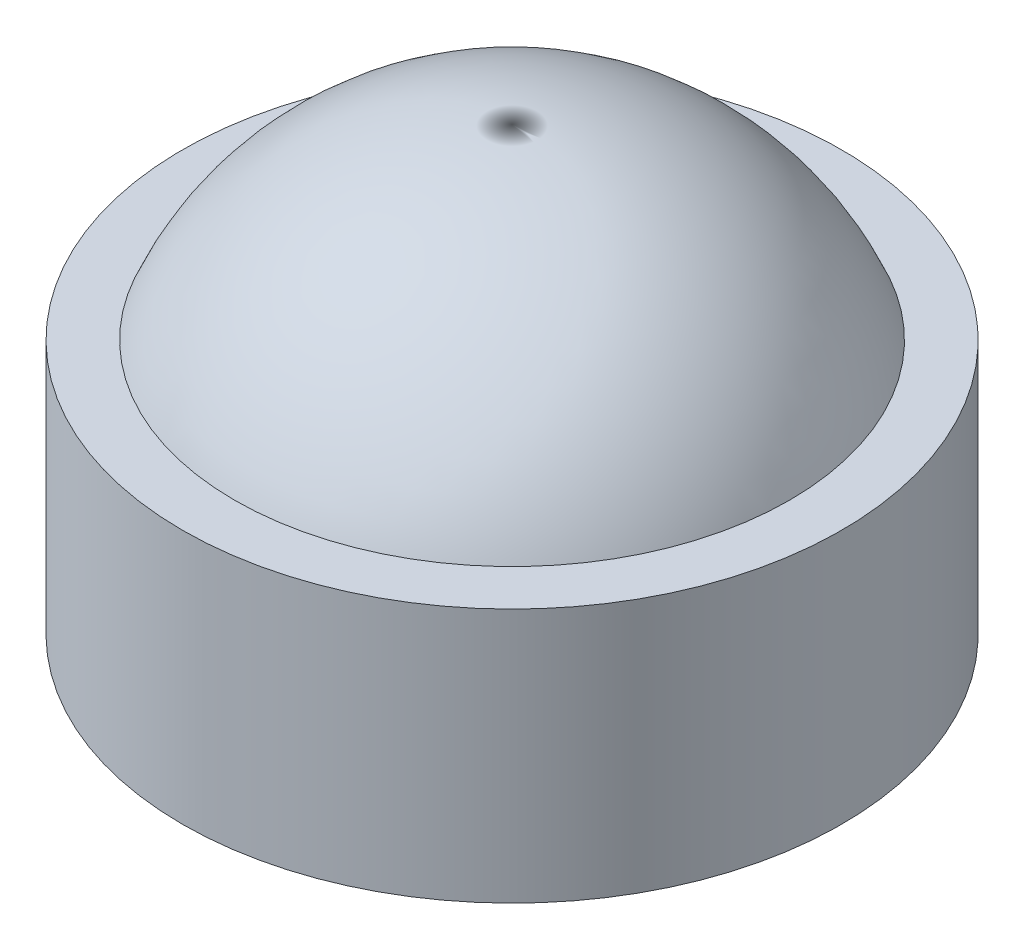
ISO-10303-21;
HEADER;
FILE_DESCRIPTION(('STEP AP214'),'2;1');
FILE_NAME('part.step','',(''),(''),'','','');
FILE_SCHEMA(('AUTOMOTIVE_DESIGN { 1 0 10303 214 1 1 1 1 }'));
ENDSEC;
DATA;
#1=APPLICATION_CONTEXT('core data for automotive mechanical design processes');
#2=APPLICATION_PROTOCOL_DEFINITION('international standard','automotive_design',2000,#1);
#3=PRODUCT_CONTEXT('',#1,'mechanical');
#4=PRODUCT('Part','Part','',(#3));
#5=PRODUCT_RELATED_PRODUCT_CATEGORY('part','',(#4));
#6=PRODUCT_DEFINITION_FORMATION('','',#4);
#7=PRODUCT_DEFINITION_CONTEXT('part definition',#1,'design');
#8=PRODUCT_DEFINITION('design','',#6,#7);
#9=PRODUCT_DEFINITION_SHAPE('','',#8);
#10=(LENGTH_UNIT() NAMED_UNIT(*) SI_UNIT(.MILLI.,.METRE.));
#11=(NAMED_UNIT(*) PLANE_ANGLE_UNIT() SI_UNIT($,.RADIAN.));
#12=(NAMED_UNIT(*) SI_UNIT($,.STERADIAN.) SOLID_ANGLE_UNIT());
#13=UNCERTAINTY_MEASURE_WITH_UNIT(LENGTH_MEASURE(1.E-05),#10,'distance_accuracy_value','');
#14=(GEOMETRIC_REPRESENTATION_CONTEXT(3) GLOBAL_UNCERTAINTY_ASSIGNED_CONTEXT((#13)) GLOBAL_UNIT_ASSIGNED_CONTEXT((#10,
#11,#12)) REPRESENTATION_CONTEXT('',''));
#15=CARTESIAN_POINT('',(0.,0.,0.));
#16=DIRECTION('',(0.,0.,1.));
#17=DIRECTION('',(1.,0.,0.));
#18=AXIS2_PLACEMENT_3D('',#15,#16,#17);
#19=CARTESIAN_POINT('',(0.,0.0085,0.));
#20=DIRECTION('',(0.,-1.,0.));
#21=DIRECTION('',(0.,0.,-1.));
#22=AXIS2_PLACEMENT_3D('',#19,#20,#21);
#23=CYLINDRICAL_SURFACE('',#22,0.011);
#24=CARTESIAN_POINT('',(0.,0.0085,0.));
#25=DIRECTION('',(0.,1.,0.));
#26=DIRECTION('',(0.,0.,1.));
#27=AXIS2_PLACEMENT_3D('',#24,#25,#26);
#28=CIRCLE('',#27,0.011);
#29=CARTESIAN_POINT('',(0.,0.0085,0.011));
#30=VERTEX_POINT('',#29);
#31=EDGE_CURVE('E39',#30,#30,#28,.T.);
#32=ORIENTED_EDGE('',*,*,#31,.F.);
#33=EDGE_LOOP('',(#32));
#34=FACE_BOUND('',#33,.T.);
#35=CARTESIAN_POINT('',(0.,0.,0.));
#36=DIRECTION('',(0.,1.,0.));
#37=DIRECTION('',(0.,0.,1.));
#38=AXIS2_PLACEMENT_3D('',#35,#36,#37);
#39=CIRCLE('',#38,0.011);
#40=CARTESIAN_POINT('',(0.,0.,0.011));
#41=VERTEX_POINT('',#40);
#42=EDGE_CURVE('E43',#41,#41,#39,.T.);
#43=ORIENTED_EDGE('',*,*,#42,.T.);
#44=EDGE_LOOP('',(#43));
#45=FACE_BOUND('',#44,.T.);
#46=ADVANCED_FACE('F33',(#34,#45),#23,.T.);
#47=CARTESIAN_POINT('',(0.,0.0085,0.));
#48=DIRECTION('',(0.,1.,0.));
#49=DIRECTION('',(0.,0.,1.));
#50=AXIS2_PLACEMENT_3D('',#47,#48,#49);
#51=PLANE('',#50);
#52=CARTESIAN_POINT('',(0.,0.0085,0.));
#53=DIRECTION('',(0.,1.,0.));
#54=DIRECTION('',(0.,0.,1.));
#55=AXIS2_PLACEMENT_3D('',#52,#53,#54);
#56=CIRCLE('',#55,0.00926213258380596);
#57=CARTESIAN_POINT('',(0.,0.0085,0.00926213258380596));
#58=VERTEX_POINT('',#57);
#59=EDGE_CURVE('E10',#58,#58,#56,.T.);
#60=ORIENTED_EDGE('',*,*,#59,.F.);
#61=EDGE_LOOP('',(#60));
#62=FACE_BOUND('',#61,.T.);
#63=ORIENTED_EDGE('',*,*,#31,.T.);
#64=EDGE_LOOP('',(#63));
#65=FACE_BOUND('',#64,.T.);
#66=ADVANCED_FACE('F54',(#62,#65),#51,.T.);
#67=CARTESIAN_POINT('',(0.,0.,0.));
#68=DIRECTION('',(0.,1.,0.));
#69=DIRECTION('',(0.,0.,1.));
#70=AXIS2_PLACEMENT_3D('',#67,#68,#69);
#71=PLANE('',#70);
#72=ORIENTED_EDGE('',*,*,#42,.F.);
#73=EDGE_LOOP('',(#72));
#74=FACE_BOUND('',#73,.T.);
#75=ADVANCED_FACE('F51',(#74),#71,.F.);
#76=CARTESIAN_POINT('',(0.,0.00473,0.));
#77=DIRECTION('',(0.,1.,0.));
#78=DIRECTION('',(1.,0.,0.));
#79=AXIS2_PLACEMENT_3D('',#76,#77,#78);
#80=SPHERICAL_SURFACE('',#79,0.01);
#81=ORIENTED_EDGE('',*,*,#59,.T.);
#82=EDGE_LOOP('',(#81));
#83=FACE_BOUND('',#82,.T.);
#84=ADVANCED_FACE('F53',(#83),#80,.T.);
#85=CLOSED_SHELL('',(#46,#66,#75,#84));
#86=MANIFOLD_SOLID_BREP('B2',#85);
#87=ADVANCED_BREP_SHAPE_REPRESENTATION('',(#18,#86),#14);
#88=SHAPE_DEFINITION_REPRESENTATION(#9,#87);
ENDSEC;
END-ISO-10303-21;
